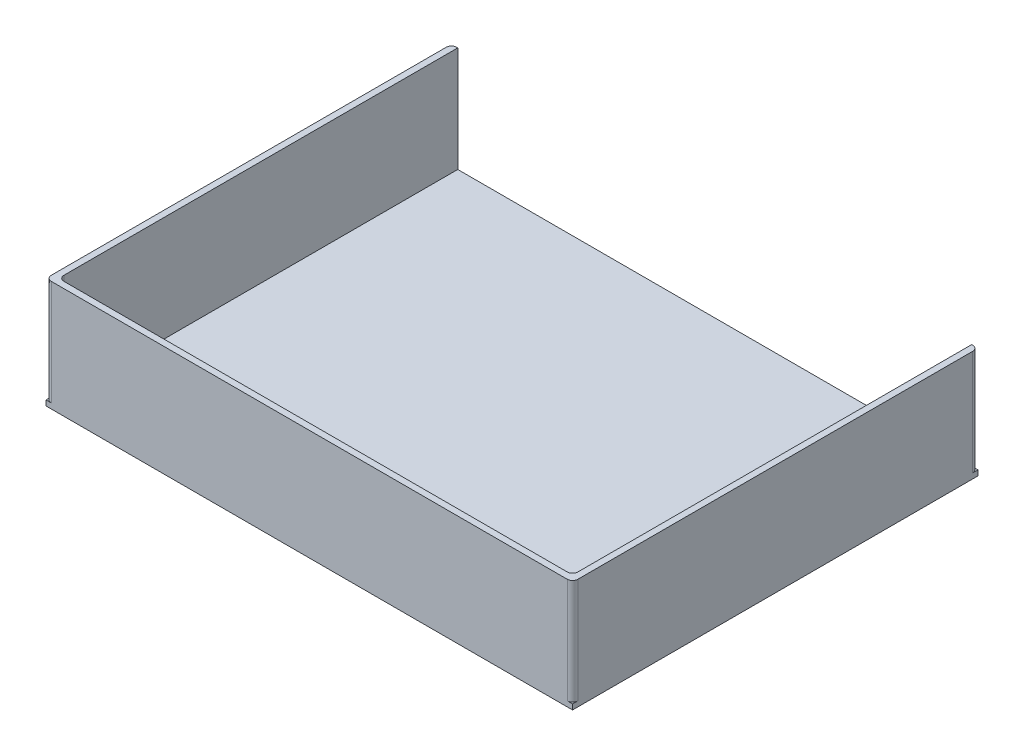
ISO-10303-21;
HEADER;
FILE_DESCRIPTION(('STEP AP214'),'2;1');
FILE_NAME('part.step','',(''),(''),'','','');
FILE_SCHEMA(('AUTOMOTIVE_DESIGN { 1 0 10303 214 1 1 1 1 }'));
ENDSEC;
DATA;
#1=APPLICATION_CONTEXT('core data for automotive mechanical design processes');
#2=APPLICATION_PROTOCOL_DEFINITION('international standard','automotive_design',2000,#1);
#3=PRODUCT_CONTEXT('',#1,'mechanical');
#4=PRODUCT('Part','Part','',(#3));
#5=PRODUCT_RELATED_PRODUCT_CATEGORY('part','',(#4));
#6=PRODUCT_DEFINITION_FORMATION('','',#4);
#7=PRODUCT_DEFINITION_CONTEXT('part definition',#1,'design');
#8=PRODUCT_DEFINITION('design','',#6,#7);
#9=PRODUCT_DEFINITION_SHAPE('','',#8);
#10=(LENGTH_UNIT() NAMED_UNIT(*) SI_UNIT(.MILLI.,.METRE.));
#11=(NAMED_UNIT(*) PLANE_ANGLE_UNIT() SI_UNIT($,.RADIAN.));
#12=(NAMED_UNIT(*) SI_UNIT($,.STERADIAN.) SOLID_ANGLE_UNIT());
#13=UNCERTAINTY_MEASURE_WITH_UNIT(LENGTH_MEASURE(1.E-05),#10,'distance_accuracy_value','');
#14=(GEOMETRIC_REPRESENTATION_CONTEXT(3) GLOBAL_UNCERTAINTY_ASSIGNED_CONTEXT((#13)) GLOBAL_UNIT_ASSIGNED_CONTEXT((#10,
#11,#12)) REPRESENTATION_CONTEXT('',''));
#15=CARTESIAN_POINT('',(0.,0.,0.));
#16=DIRECTION('',(0.,0.,1.));
#17=DIRECTION('',(1.,0.,0.));
#18=AXIS2_PLACEMENT_3D('',#15,#16,#17);
#19=CARTESIAN_POINT('',(0.,5.,0.));
#20=DIRECTION('',(0.,-1.,0.));
#21=DIRECTION('',(0.,0.,-1.));
#22=AXIS2_PLACEMENT_3D('',#19,#20,#21);
#23=PLANE('',#22);
#24=DIRECTION('',(0.,0.,-1.));
#25=VECTOR('',#24,1.);
#26=CARTESIAN_POINT('',(-244.,5.,-186.5));
#27=LINE('',#26,#25);
#28=CARTESIAN_POINT('',(-244.,5.,181.5));
#29=VERTEX_POINT('',#28);
#30=CARTESIAN_POINT('',(-244.,5.,-192.5));
#31=VERTEX_POINT('',#30);
#32=EDGE_CURVE('E48',#29,#31,#27,.T.);
#33=ORIENTED_EDGE('',*,*,#32,.F.);
#34=CARTESIAN_POINT('',(-239.,5.,181.5));
#35=DIRECTION('',(0.,-1.,0.));
#36=DIRECTION('',(0.,0.,1.));
#37=AXIS2_PLACEMENT_3D('',#34,#35,#36);
#38=CIRCLE('',#37,5.);
#39=CARTESIAN_POINT('',(-239.,5.,186.5));
#40=VERTEX_POINT('',#39);
#41=EDGE_CURVE('E52',#40,#29,#38,.T.);
#42=ORIENTED_EDGE('',*,*,#41,.F.);
#43=DIRECTION('',(-1.,0.,0.));
#44=VECTOR('',#43,1.);
#45=CARTESIAN_POINT('',(-239.,5.,186.5));
#46=LINE('',#45,#44);
#47=CARTESIAN_POINT('',(239.,5.,186.5));
#48=VERTEX_POINT('',#47);
#49=EDGE_CURVE('E261',#48,#40,#46,.T.);
#50=ORIENTED_EDGE('',*,*,#49,.F.);
#51=CARTESIAN_POINT('',(239.,5.,181.5));
#52=DIRECTION('',(0.,-1.,0.));
#53=DIRECTION('',(0.,0.,1.));
#54=AXIS2_PLACEMENT_3D('',#51,#52,#53);
#55=CIRCLE('',#54,5.);
#56=CARTESIAN_POINT('',(244.,5.,181.5));
#57=VERTEX_POINT('',#56);
#58=EDGE_CURVE('E258',#57,#48,#55,.T.);
#59=ORIENTED_EDGE('',*,*,#58,.F.);
#60=DIRECTION('',(0.,0.,1.));
#61=VECTOR('',#60,1.);
#62=CARTESIAN_POINT('',(244.,5.,181.5));
#63=LINE('',#62,#61);
#64=CARTESIAN_POINT('',(244.,5.,-192.5));
#65=VERTEX_POINT('',#64);
#66=EDGE_CURVE('E249',#65,#57,#63,.T.);
#67=ORIENTED_EDGE('',*,*,#66,.F.);
#68=DIRECTION('',(-1.,0.,0.));
#69=VECTOR('',#68,1.);
#70=CARTESIAN_POINT('',(-250.,5.,-192.5));
#71=LINE('',#70,#69);
#72=EDGE_CURVE('E195',#65,#31,#71,.T.);
#73=ORIENTED_EDGE('',*,*,#72,.T.);
#74=EDGE_LOOP('',(#33,#42,#50,#59,#67,#73));
#75=FACE_BOUND('',#74,.T.);
#76=ADVANCED_FACE('F33',(#75),#23,.F.);
#77=CARTESIAN_POINT('',(245.,5.,-187.5));
#78=DIRECTION('',(0.,1.,0.));
#79=DIRECTION('',(0.,0.,1.));
#80=AXIS2_PLACEMENT_3D('',#77,#78,#79);
#81=CIRCLE('',#80,4.99999999999999);
#82=CARTESIAN_POINT('',(250.,5.,-187.5));
#83=VERTEX_POINT('',#82);
#84=CARTESIAN_POINT('',(245.,5.,-192.5));
#85=VERTEX_POINT('',#84);
#86=EDGE_CURVE('E245',#83,#85,#81,.T.);
#87=ORIENTED_EDGE('',*,*,#86,.F.);
#88=DIRECTION('',(0.,0.,-1.));
#89=VECTOR('',#88,1.);
#90=CARTESIAN_POINT('',(250.,5.,192.5));
#91=LINE('',#90,#89);
#92=CARTESIAN_POINT('',(250.,5.,-192.5));
#93=VERTEX_POINT('',#92);
#94=EDGE_CURVE('E191',#83,#93,#91,.T.);
#95=ORIENTED_EDGE('',*,*,#94,.T.);
#96=EDGE_CURVE('E192',#93,#85,#71,.T.);
#97=ORIENTED_EDGE('',*,*,#96,.T.);
#98=EDGE_LOOP('',(#87,#95,#97));
#99=FACE_BOUND('',#98,.T.);
#100=ADVANCED_FACE('F359',(#99),#23,.F.);
#101=CARTESIAN_POINT('',(245.,5.,187.5));
#102=DIRECTION('',(0.,1.,0.));
#103=DIRECTION('',(0.,0.,-1.));
#104=AXIS2_PLACEMENT_3D('',#101,#102,#103);
#105=CIRCLE('',#104,5.);
#106=CARTESIAN_POINT('',(245.,5.,192.5));
#107=VERTEX_POINT('',#106);
#108=CARTESIAN_POINT('',(250.,5.,187.5));
#109=VERTEX_POINT('',#108);
#110=EDGE_CURVE('E238',#107,#109,#105,.T.);
#111=ORIENTED_EDGE('',*,*,#110,.F.);
#112=DIRECTION('',(1.,0.,0.));
#113=VECTOR('',#112,1.);
#114=CARTESIAN_POINT('',(-250.,5.,192.5));
#115=LINE('',#114,#113);
#116=CARTESIAN_POINT('',(250.,5.,192.5));
#117=VERTEX_POINT('',#116);
#118=EDGE_CURVE('E198',#107,#117,#115,.T.);
#119=ORIENTED_EDGE('',*,*,#118,.T.);
#120=EDGE_CURVE('E188',#117,#109,#91,.T.);
#121=ORIENTED_EDGE('',*,*,#120,.T.);
#122=EDGE_LOOP('',(#111,#119,#121));
#123=FACE_BOUND('',#122,.T.);
#124=ADVANCED_FACE('F237',(#123),#23,.F.);
#125=CARTESIAN_POINT('',(-245.,5.,187.5));
#126=DIRECTION('',(0.,1.,0.));
#127=DIRECTION('',(0.,0.,-1.));
#128=AXIS2_PLACEMENT_3D('',#125,#126,#127);
#129=CIRCLE('',#128,5.00000000000002);
#130=CARTESIAN_POINT('',(-250.,5.,187.5));
#131=VERTEX_POINT('',#130);
#132=CARTESIAN_POINT('',(-245.,5.,192.5));
#133=VERTEX_POINT('',#132);
#134=EDGE_CURVE('E246',#131,#133,#129,.T.);
#135=ORIENTED_EDGE('',*,*,#134,.F.);
#136=DIRECTION('',(0.,0.,1.));
#137=VECTOR('',#136,1.);
#138=CARTESIAN_POINT('',(-250.,5.,192.5));
#139=LINE('',#138,#137);
#140=CARTESIAN_POINT('',(-250.,5.,192.5));
#141=VERTEX_POINT('',#140);
#142=EDGE_CURVE('E194',#131,#141,#139,.T.);
#143=ORIENTED_EDGE('',*,*,#142,.T.);
#144=EDGE_CURVE('E199',#141,#133,#115,.T.);
#145=ORIENTED_EDGE('',*,*,#144,.T.);
#146=EDGE_LOOP('',(#135,#143,#145));
#147=FACE_BOUND('',#146,.T.);
#148=ADVANCED_FACE('F369',(#147),#23,.F.);
#149=CARTESIAN_POINT('',(250.,5.,192.5));
#150=DIRECTION('',(-1.,0.,0.));
#151=DIRECTION('',(0.,0.,1.));
#152=AXIS2_PLACEMENT_3D('',#149,#150,#151);
#153=PLANE('',#152);
#154=DIRECTION('',(0.,0.,-1.));
#155=VECTOR('',#154,1.);
#156=CARTESIAN_POINT('',(250.,0.,192.5));
#157=LINE('',#156,#155);
#158=CARTESIAN_POINT('',(250.,0.,192.5));
#159=VERTEX_POINT('',#158);
#160=CARTESIAN_POINT('',(250.,0.,-192.5));
#161=VERTEX_POINT('',#160);
#162=EDGE_CURVE('E179',#159,#161,#157,.T.);
#163=ORIENTED_EDGE('',*,*,#162,.T.);
#164=DIRECTION('',(0.,-1.,0.));
#165=VECTOR('',#164,1.);
#166=CARTESIAN_POINT('',(250.,5.,-192.5));
#167=LINE('',#166,#165);
#168=EDGE_CURVE('E11',#93,#161,#167,.T.);
#169=ORIENTED_EDGE('',*,*,#168,.F.);
#170=ORIENTED_EDGE('',*,*,#94,.F.);
#171=DIRECTION('',(0.,-1.,0.));
#172=VECTOR('',#171,1.);
#173=CARTESIAN_POINT('',(250.,105.,-187.5));
#174=LINE('',#173,#172);
#175=CARTESIAN_POINT('',(250.,105.,-187.5));
#176=VERTEX_POINT('',#175);
#177=EDGE_CURVE('E282',#176,#83,#174,.T.);
#178=ORIENTED_EDGE('',*,*,#177,.F.);
#179=DIRECTION('',(0.,0.,-1.));
#180=VECTOR('',#179,1.);
#181=CARTESIAN_POINT('',(250.,105.,187.5));
#182=LINE('',#181,#180);
#183=CARTESIAN_POINT('',(250.,105.,187.5));
#184=VERTEX_POINT('',#183);
#185=EDGE_CURVE('E312',#184,#176,#182,.T.);
#186=ORIENTED_EDGE('',*,*,#185,.F.);
#187=DIRECTION('',(0.,-1.,0.));
#188=VECTOR('',#187,1.);
#189=CARTESIAN_POINT('',(250.,105.,187.5));
#190=LINE('',#189,#188);
#191=EDGE_CURVE('E234',#184,#109,#190,.T.);
#192=ORIENTED_EDGE('',*,*,#191,.T.);
#193=ORIENTED_EDGE('',*,*,#120,.F.);
#194=DIRECTION('',(0.,-1.,0.));
#195=VECTOR('',#194,1.);
#196=CARTESIAN_POINT('',(250.,5.,192.5));
#197=LINE('',#196,#195);
#198=EDGE_CURVE('E200',#117,#159,#197,.T.);
#199=ORIENTED_EDGE('',*,*,#198,.T.);
#200=EDGE_LOOP('',(#163,#169,#170,#178,#186,#192,#193,#199));
#201=FACE_BOUND('',#200,.T.);
#202=ADVANCED_FACE('F35',(#201),#153,.F.);
#203=CARTESIAN_POINT('',(-250.,5.,-192.5));
#204=DIRECTION('',(0.,0.,1.));
#205=DIRECTION('',(1.,0.,0.));
#206=AXIS2_PLACEMENT_3D('',#203,#204,#205);
#207=PLANE('',#206);
#208=DIRECTION('',(-1.,0.,0.));
#209=VECTOR('',#208,1.);
#210=CARTESIAN_POINT('',(-250.,0.,-192.5));
#211=LINE('',#210,#209);
#212=CARTESIAN_POINT('',(-250.,0.,-192.5));
#213=VERTEX_POINT('',#212);
#214=EDGE_CURVE('E182',#161,#213,#211,.T.);
#215=ORIENTED_EDGE('',*,*,#214,.T.);
#216=DIRECTION('',(0.,-1.,0.));
#217=VECTOR('',#216,1.);
#218=CARTESIAN_POINT('',(-250.,5.,-192.5));
#219=LINE('',#218,#217);
#220=CARTESIAN_POINT('',(-250.,5.,-192.5));
#221=VERTEX_POINT('',#220);
#222=EDGE_CURVE('E41',#221,#213,#219,.T.);
#223=ORIENTED_EDGE('',*,*,#222,.F.);
#224=CARTESIAN_POINT('',(-245.,5.,-192.5));
#225=VERTEX_POINT('',#224);
#226=EDGE_CURVE('E190',#225,#221,#71,.T.);
#227=ORIENTED_EDGE('',*,*,#226,.F.);
#228=DIRECTION('',(0.,-1.,0.));
#229=VECTOR('',#228,1.);
#230=CARTESIAN_POINT('',(-245.,105.,-192.5));
#231=LINE('',#230,#229);
#232=CARTESIAN_POINT('',(-245.,105.,-192.5));
#233=VERTEX_POINT('',#232);
#234=EDGE_CURVE('E164',#233,#225,#231,.T.);
#235=ORIENTED_EDGE('',*,*,#234,.F.);
#236=DIRECTION('',(-1.,0.,0.));
#237=VECTOR('',#236,1.);
#238=CARTESIAN_POINT('',(-244.,105.,-192.5));
#239=LINE('',#238,#237);
#240=CARTESIAN_POINT('',(-244.,105.,-192.5));
#241=VERTEX_POINT('',#240);
#242=EDGE_CURVE('E156',#241,#233,#239,.T.);
#243=ORIENTED_EDGE('',*,*,#242,.F.);
#244=DIRECTION('',(0.,-1.,0.));
#245=VECTOR('',#244,1.);
#246=CARTESIAN_POINT('',(-244.,105.,-192.5));
#247=LINE('',#246,#245);
#248=EDGE_CURVE('E161',#241,#31,#247,.T.);
#249=ORIENTED_EDGE('',*,*,#248,.T.);
#250=ORIENTED_EDGE('',*,*,#72,.F.);
#251=DIRECTION('',(0.,-1.,0.));
#252=VECTOR('',#251,1.);
#253=CARTESIAN_POINT('',(244.,105.,-192.5));
#254=LINE('',#253,#252);
#255=CARTESIAN_POINT('',(244.,105.,-192.5));
#256=VERTEX_POINT('',#255);
#257=EDGE_CURVE('E276',#256,#65,#254,.T.);
#258=ORIENTED_EDGE('',*,*,#257,.F.);
#259=DIRECTION('',(-1.,0.,0.));
#260=VECTOR('',#259,1.);
#261=CARTESIAN_POINT('',(245.,105.,-192.5));
#262=LINE('',#261,#260);
#263=CARTESIAN_POINT('',(245.,105.,-192.5));
#264=VERTEX_POINT('',#263);
#265=EDGE_CURVE('E308',#264,#256,#262,.T.);
#266=ORIENTED_EDGE('',*,*,#265,.F.);
#267=DIRECTION('',(0.,-1.,0.));
#268=VECTOR('',#267,1.);
#269=CARTESIAN_POINT('',(245.,105.,-192.5));
#270=LINE('',#269,#268);
#271=EDGE_CURVE('E279',#264,#85,#270,.T.);
#272=ORIENTED_EDGE('',*,*,#271,.T.);
#273=ORIENTED_EDGE('',*,*,#96,.F.);
#274=ORIENTED_EDGE('',*,*,#168,.T.);
#275=EDGE_LOOP('',(#215,#223,#227,#235,#243,#249,#250,#258,#266,#272,#273,#274));
#276=FACE_BOUND('',#275,.T.);
#277=ADVANCED_FACE('F158',(#276),#207,.F.);
#278=CARTESIAN_POINT('',(-250.,5.,192.5));
#279=DIRECTION('',(1.,0.,0.));
#280=DIRECTION('',(0.,0.,-1.));
#281=AXIS2_PLACEMENT_3D('',#278,#279,#280);
#282=PLANE('',#281);
#283=DIRECTION('',(0.,0.,1.));
#284=VECTOR('',#283,1.);
#285=CARTESIAN_POINT('',(-250.,0.,192.5));
#286=LINE('',#285,#284);
#287=CARTESIAN_POINT('',(-250.,0.,192.5));
#288=VERTEX_POINT('',#287);
#289=EDGE_CURVE('E203',#213,#288,#286,.T.);
#290=ORIENTED_EDGE('',*,*,#289,.T.);
#291=DIRECTION('',(0.,-1.,0.));
#292=VECTOR('',#291,1.);
#293=CARTESIAN_POINT('',(-250.,5.,192.5));
#294=LINE('',#293,#292);
#295=EDGE_CURVE('E209',#141,#288,#294,.T.);
#296=ORIENTED_EDGE('',*,*,#295,.F.);
#297=ORIENTED_EDGE('',*,*,#142,.F.);
#298=DIRECTION('',(0.,-1.,0.));
#299=VECTOR('',#298,1.);
#300=CARTESIAN_POINT('',(-250.,105.,187.5));
#301=LINE('',#300,#299);
#302=CARTESIAN_POINT('',(-250.,105.,187.5));
#303=VERTEX_POINT('',#302);
#304=EDGE_CURVE('E290',#303,#131,#301,.T.);
#305=ORIENTED_EDGE('',*,*,#304,.F.);
#306=DIRECTION('',(0.,0.,1.));
#307=VECTOR('',#306,1.);
#308=CARTESIAN_POINT('',(-250.,105.,-187.5));
#309=LINE('',#308,#307);
#310=CARTESIAN_POINT('',(-250.,105.,-187.5));
#311=VERTEX_POINT('',#310);
#312=EDGE_CURVE('E295',#311,#303,#309,.T.);
#313=ORIENTED_EDGE('',*,*,#312,.F.);
#314=DIRECTION('',(0.,-1.,0.));
#315=VECTOR('',#314,1.);
#316=CARTESIAN_POINT('',(-250.,105.,-187.5));
#317=LINE('',#316,#315);
#318=CARTESIAN_POINT('',(-250.,5.,-187.5));
#319=VERTEX_POINT('',#318);
#320=EDGE_CURVE('E184',#311,#319,#317,.T.);
#321=ORIENTED_EDGE('',*,*,#320,.T.);
#322=EDGE_CURVE('E196',#221,#319,#139,.T.);
#323=ORIENTED_EDGE('',*,*,#322,.F.);
#324=ORIENTED_EDGE('',*,*,#222,.T.);
#325=EDGE_LOOP('',(#290,#296,#297,#305,#313,#321,#323,#324));
#326=FACE_BOUND('',#325,.T.);
#327=ADVANCED_FACE('F216',(#326),#282,.F.);
#328=CARTESIAN_POINT('',(-250.,5.,192.5));
#329=DIRECTION('',(0.,0.,-1.));
#330=DIRECTION('',(-1.,0.,0.));
#331=AXIS2_PLACEMENT_3D('',#328,#329,#330);
#332=PLANE('',#331);
#333=DIRECTION('',(1.,0.,0.));
#334=VECTOR('',#333,1.);
#335=CARTESIAN_POINT('',(-250.,0.,192.5));
#336=LINE('',#335,#334);
#337=EDGE_CURVE('E205',#288,#159,#336,.T.);
#338=ORIENTED_EDGE('',*,*,#337,.T.);
#339=ORIENTED_EDGE('',*,*,#198,.F.);
#340=ORIENTED_EDGE('',*,*,#118,.F.);
#341=DIRECTION('',(0.,-1.,0.));
#342=VECTOR('',#341,1.);
#343=CARTESIAN_POINT('',(245.,105.,192.5));
#344=LINE('',#343,#342);
#345=CARTESIAN_POINT('',(245.,105.,192.5));
#346=VERTEX_POINT('',#345);
#347=EDGE_CURVE('E244',#346,#107,#344,.T.);
#348=ORIENTED_EDGE('',*,*,#347,.F.);
#349=DIRECTION('',(1.,0.,0.));
#350=VECTOR('',#349,1.);
#351=CARTESIAN_POINT('',(-245.,105.,192.5));
#352=LINE('',#351,#350);
#353=CARTESIAN_POINT('',(-245.,105.,192.5));
#354=VERTEX_POINT('',#353);
#355=EDGE_CURVE('E316',#354,#346,#352,.T.);
#356=ORIENTED_EDGE('',*,*,#355,.F.);
#357=DIRECTION('',(0.,-1.,0.));
#358=VECTOR('',#357,1.);
#359=CARTESIAN_POINT('',(-245.,105.,192.5));
#360=LINE('',#359,#358);
#361=EDGE_CURVE('E287',#354,#133,#360,.T.);
#362=ORIENTED_EDGE('',*,*,#361,.T.);
#363=ORIENTED_EDGE('',*,*,#144,.F.);
#364=ORIENTED_EDGE('',*,*,#295,.T.);
#365=EDGE_LOOP('',(#338,#339,#340,#348,#356,#362,#363,#364));
#366=FACE_BOUND('',#365,.T.);
#367=ADVANCED_FACE('F225',(#366),#332,.F.);
#368=CARTESIAN_POINT('',(-245.,5.,-187.5));
#369=DIRECTION('',(0.,1.,0.));
#370=DIRECTION('',(0.,0.,-1.));
#371=AXIS2_PLACEMENT_3D('',#368,#369,#370);
#372=CIRCLE('',#371,5.);
#373=EDGE_CURVE('E252',#225,#319,#372,.T.);
#374=ORIENTED_EDGE('',*,*,#373,.F.);
#375=ORIENTED_EDGE('',*,*,#226,.T.);
#376=ORIENTED_EDGE('',*,*,#322,.T.);
#377=EDGE_LOOP('',(#374,#375,#376));
#378=FACE_BOUND('',#377,.T.);
#379=ADVANCED_FACE('F361',(#378),#23,.F.);
#380=CARTESIAN_POINT('',(0.,0.,0.));
#381=DIRECTION('',(0.,-1.,0.));
#382=DIRECTION('',(0.,0.,-1.));
#383=AXIS2_PLACEMENT_3D('',#380,#381,#382);
#384=PLANE('',#383);
#385=ORIENTED_EDGE('',*,*,#162,.F.);
#386=ORIENTED_EDGE('',*,*,#337,.F.);
#387=ORIENTED_EDGE('',*,*,#289,.F.);
#388=ORIENTED_EDGE('',*,*,#214,.F.);
#389=EDGE_LOOP('',(#385,#386,#387,#388));
#390=FACE_BOUND('',#389,.T.);
#391=ADVANCED_FACE('F222',(#390),#384,.T.);
#392=CARTESIAN_POINT('',(-245.,105.,-187.5));
#393=DIRECTION('',(0.,-1.,0.));
#394=DIRECTION('',(0.,0.,-1.));
#395=AXIS2_PLACEMENT_3D('',#392,#393,#394);
#396=CYLINDRICAL_SURFACE('',#395,5.);
#397=ORIENTED_EDGE('',*,*,#373,.T.);
#398=ORIENTED_EDGE('',*,*,#320,.F.);
#399=CARTESIAN_POINT('',(-245.,105.,-187.5));
#400=DIRECTION('',(0.,1.,0.));
#401=DIRECTION('',(0.,0.,-1.));
#402=AXIS2_PLACEMENT_3D('',#399,#400,#401);
#403=CIRCLE('',#402,5.);
#404=EDGE_CURVE('E167',#233,#311,#403,.T.);
#405=ORIENTED_EDGE('',*,*,#404,.F.);
#406=ORIENTED_EDGE('',*,*,#234,.T.);
#407=EDGE_LOOP('',(#397,#398,#405,#406));
#408=FACE_BOUND('',#407,.T.);
#409=ADVANCED_FACE('F298',(#408),#396,.T.);
#410=CARTESIAN_POINT('',(-245.,105.,187.5));
#411=DIRECTION('',(0.,-1.,0.));
#412=DIRECTION('',(0.,0.,-1.));
#413=AXIS2_PLACEMENT_3D('',#410,#411,#412);
#414=CYLINDRICAL_SURFACE('',#413,5.00000000000002);
#415=ORIENTED_EDGE('',*,*,#134,.T.);
#416=ORIENTED_EDGE('',*,*,#361,.F.);
#417=CARTESIAN_POINT('',(-245.,105.,187.5));
#418=DIRECTION('',(0.,1.,0.));
#419=DIRECTION('',(0.,0.,-1.));
#420=AXIS2_PLACEMENT_3D('',#417,#418,#419);
#421=CIRCLE('',#420,5.00000000000002);
#422=EDGE_CURVE('E318',#303,#354,#421,.T.);
#423=ORIENTED_EDGE('',*,*,#422,.F.);
#424=ORIENTED_EDGE('',*,*,#304,.T.);
#425=EDGE_LOOP('',(#415,#416,#423,#424));
#426=FACE_BOUND('',#425,.T.);
#427=ADVANCED_FACE('F325',(#426),#414,.T.);
#428=CARTESIAN_POINT('',(245.,105.,187.5));
#429=DIRECTION('',(0.,-1.,0.));
#430=DIRECTION('',(0.,0.,-1.));
#431=AXIS2_PLACEMENT_3D('',#428,#429,#430);
#432=CYLINDRICAL_SURFACE('',#431,5.);
#433=ORIENTED_EDGE('',*,*,#110,.T.);
#434=ORIENTED_EDGE('',*,*,#191,.F.);
#435=CARTESIAN_POINT('',(245.,105.,187.5));
#436=DIRECTION('',(0.,1.,0.));
#437=DIRECTION('',(0.,0.,-1.));
#438=AXIS2_PLACEMENT_3D('',#435,#436,#437);
#439=CIRCLE('',#438,5.);
#440=EDGE_CURVE('E314',#346,#184,#439,.T.);
#441=ORIENTED_EDGE('',*,*,#440,.F.);
#442=ORIENTED_EDGE('',*,*,#347,.T.);
#443=EDGE_LOOP('',(#433,#434,#441,#442));
#444=FACE_BOUND('',#443,.T.);
#445=ADVANCED_FACE('F241',(#444),#432,.T.);
#446=CARTESIAN_POINT('',(245.,105.,-187.5));
#447=DIRECTION('',(0.,-1.,0.));
#448=DIRECTION('',(0.,0.,-1.));
#449=AXIS2_PLACEMENT_3D('',#446,#447,#448);
#450=CYLINDRICAL_SURFACE('',#449,4.99999999999999);
#451=ORIENTED_EDGE('',*,*,#86,.T.);
#452=ORIENTED_EDGE('',*,*,#271,.F.);
#453=CARTESIAN_POINT('',(245.,105.,-187.5));
#454=DIRECTION('',(0.,1.,0.));
#455=DIRECTION('',(0.,0.,1.));
#456=AXIS2_PLACEMENT_3D('',#453,#454,#455);
#457=CIRCLE('',#456,4.99999999999999);
#458=EDGE_CURVE('E310',#176,#264,#457,.T.);
#459=ORIENTED_EDGE('',*,*,#458,.F.);
#460=ORIENTED_EDGE('',*,*,#177,.T.);
#461=EDGE_LOOP('',(#451,#452,#459,#460));
#462=FACE_BOUND('',#461,.T.);
#463=ADVANCED_FACE('F332',(#462),#450,.T.);
#464=CARTESIAN_POINT('',(244.,105.,181.5));
#465=DIRECTION('',(1.,0.,0.));
#466=DIRECTION('',(0.,0.,-1.));
#467=AXIS2_PLACEMENT_3D('',#464,#465,#466);
#468=PLANE('',#467);
#469=ORIENTED_EDGE('',*,*,#66,.T.);
#470=DIRECTION('',(0.,-1.,0.));
#471=VECTOR('',#470,1.);
#472=CARTESIAN_POINT('',(244.,105.,181.5));
#473=LINE('',#472,#471);
#474=CARTESIAN_POINT('',(244.,105.,181.5));
#475=VERTEX_POINT('',#474);
#476=EDGE_CURVE('E273',#475,#57,#473,.T.);
#477=ORIENTED_EDGE('',*,*,#476,.F.);
#478=DIRECTION('',(0.,0.,1.));
#479=VECTOR('',#478,1.);
#480=CARTESIAN_POINT('',(244.,105.,-186.5));
#481=LINE('',#480,#479);
#482=EDGE_CURVE('E306',#256,#475,#481,.T.);
#483=ORIENTED_EDGE('',*,*,#482,.F.);
#484=ORIENTED_EDGE('',*,*,#257,.T.);
#485=EDGE_LOOP('',(#469,#477,#483,#484));
#486=FACE_BOUND('',#485,.T.);
#487=ADVANCED_FACE('F341',(#486),#468,.F.);
#488=CARTESIAN_POINT('',(239.,105.,181.5));
#489=DIRECTION('',(0.,-1.,0.));
#490=DIRECTION('',(0.,0.,-1.));
#491=AXIS2_PLACEMENT_3D('',#488,#489,#490);
#492=CYLINDRICAL_SURFACE('',#491,5.);
#493=ORIENTED_EDGE('',*,*,#58,.T.);
#494=DIRECTION('',(0.,-1.,0.));
#495=VECTOR('',#494,1.);
#496=CARTESIAN_POINT('',(239.,105.,186.5));
#497=LINE('',#496,#495);
#498=CARTESIAN_POINT('',(239.,105.,186.5));
#499=VERTEX_POINT('',#498);
#500=EDGE_CURVE('E270',#499,#48,#497,.T.);
#501=ORIENTED_EDGE('',*,*,#500,.F.);
#502=CARTESIAN_POINT('',(239.,105.,181.5));
#503=DIRECTION('',(0.,-1.,0.));
#504=DIRECTION('',(0.,0.,1.));
#505=AXIS2_PLACEMENT_3D('',#502,#503,#504);
#506=CIRCLE('',#505,5.);
#507=EDGE_CURVE('E304',#475,#499,#506,.T.);
#508=ORIENTED_EDGE('',*,*,#507,.F.);
#509=ORIENTED_EDGE('',*,*,#476,.T.);
#510=EDGE_LOOP('',(#493,#501,#508,#509));
#511=FACE_BOUND('',#510,.T.);
#512=ADVANCED_FACE('F343',(#511),#492,.F.);
#513=CARTESIAN_POINT('',(-239.,105.,186.5));
#514=DIRECTION('',(0.,0.,1.));
#515=DIRECTION('',(1.,0.,0.));
#516=AXIS2_PLACEMENT_3D('',#513,#514,#515);
#517=PLANE('',#516);
#518=ORIENTED_EDGE('',*,*,#49,.T.);
#519=DIRECTION('',(0.,-1.,0.));
#520=VECTOR('',#519,1.);
#521=CARTESIAN_POINT('',(-239.,105.,186.5));
#522=LINE('',#521,#520);
#523=CARTESIAN_POINT('',(-239.,105.,186.5));
#524=VERTEX_POINT('',#523);
#525=EDGE_CURVE('E267',#524,#40,#522,.T.);
#526=ORIENTED_EDGE('',*,*,#525,.F.);
#527=DIRECTION('',(-1.,0.,0.));
#528=VECTOR('',#527,1.);
#529=CARTESIAN_POINT('',(-239.,105.,186.5));
#530=LINE('',#529,#528);
#531=EDGE_CURVE('E302',#499,#524,#530,.T.);
#532=ORIENTED_EDGE('',*,*,#531,.F.);
#533=ORIENTED_EDGE('',*,*,#500,.T.);
#534=EDGE_LOOP('',(#518,#526,#532,#533));
#535=FACE_BOUND('',#534,.T.);
#536=ADVANCED_FACE('F347',(#535),#517,.F.);
#537=CARTESIAN_POINT('',(-239.,105.,181.5));
#538=DIRECTION('',(0.,-1.,0.));
#539=DIRECTION('',(0.,0.,-1.));
#540=AXIS2_PLACEMENT_3D('',#537,#538,#539);
#541=CYLINDRICAL_SURFACE('',#540,5.);
#542=ORIENTED_EDGE('',*,*,#41,.T.);
#543=DIRECTION('',(0.,-1.,0.));
#544=VECTOR('',#543,1.);
#545=CARTESIAN_POINT('',(-244.,105.,181.5));
#546=LINE('',#545,#544);
#547=CARTESIAN_POINT('',(-244.,105.,181.5));
#548=VERTEX_POINT('',#547);
#549=EDGE_CURVE('E265',#548,#29,#546,.T.);
#550=ORIENTED_EDGE('',*,*,#549,.F.);
#551=CARTESIAN_POINT('',(-239.,105.,181.5));
#552=DIRECTION('',(0.,-1.,0.));
#553=DIRECTION('',(0.,0.,1.));
#554=AXIS2_PLACEMENT_3D('',#551,#552,#553);
#555=CIRCLE('',#554,5.);
#556=EDGE_CURVE('E173',#524,#548,#555,.T.);
#557=ORIENTED_EDGE('',*,*,#556,.F.);
#558=ORIENTED_EDGE('',*,*,#525,.T.);
#559=EDGE_LOOP('',(#542,#550,#557,#558));
#560=FACE_BOUND('',#559,.T.);
#561=ADVANCED_FACE('F349',(#560),#541,.F.);
#562=CARTESIAN_POINT('',(-244.,105.,-186.5));
#563=DIRECTION('',(-1.,0.,0.));
#564=DIRECTION('',(0.,0.,1.));
#565=AXIS2_PLACEMENT_3D('',#562,#563,#564);
#566=PLANE('',#565);
#567=ORIENTED_EDGE('',*,*,#32,.T.);
#568=ORIENTED_EDGE('',*,*,#248,.F.);
#569=DIRECTION('',(0.,0.,-1.));
#570=VECTOR('',#569,1.);
#571=CARTESIAN_POINT('',(-244.,105.,-186.5));
#572=LINE('',#571,#570);
#573=EDGE_CURVE('E168',#548,#241,#572,.T.);
#574=ORIENTED_EDGE('',*,*,#573,.F.);
#575=ORIENTED_EDGE('',*,*,#549,.T.);
#576=EDGE_LOOP('',(#567,#568,#574,#575));
#577=FACE_BOUND('',#576,.T.);
#578=ADVANCED_FACE('F178',(#577),#566,.F.);
#579=CARTESIAN_POINT('',(-245.,105.,-187.5));
#580=DIRECTION('',(0.,-1.,0.));
#581=DIRECTION('',(0.,0.,-1.));
#582=AXIS2_PLACEMENT_3D('',#579,#580,#581);
#583=PLANE('',#582);
#584=ORIENTED_EDGE('',*,*,#573,.T.);
#585=ORIENTED_EDGE('',*,*,#242,.T.);
#586=ORIENTED_EDGE('',*,*,#404,.T.);
#587=ORIENTED_EDGE('',*,*,#312,.T.);
#588=ORIENTED_EDGE('',*,*,#422,.T.);
#589=ORIENTED_EDGE('',*,*,#355,.T.);
#590=ORIENTED_EDGE('',*,*,#440,.T.);
#591=ORIENTED_EDGE('',*,*,#185,.T.);
#592=ORIENTED_EDGE('',*,*,#458,.T.);
#593=ORIENTED_EDGE('',*,*,#265,.T.);
#594=ORIENTED_EDGE('',*,*,#482,.T.);
#595=ORIENTED_EDGE('',*,*,#507,.T.);
#596=ORIENTED_EDGE('',*,*,#531,.T.);
#597=ORIENTED_EDGE('',*,*,#556,.T.);
#598=EDGE_LOOP('',(#584,#585,#586,#587,#588,#589,#590,#591,#592,#593,#594,#595,#596,#597));
#599=FACE_BOUND('',#598,.T.);
#600=ADVANCED_FACE('F171',(#599),#583,.F.);
#601=CLOSED_SHELL('',(#76,#100,#124,#148,#202,#277,#327,#367,#379,#391,#409,#427,#445,#463,#487,
#512,#536,#561,#578,#600));
#602=MANIFOLD_SOLID_BREP('B2',#601);
#603=ADVANCED_BREP_SHAPE_REPRESENTATION('',(#18,#602),#14);
#604=SHAPE_DEFINITION_REPRESENTATION(#9,#603);
ENDSEC;
END-ISO-10303-21;
